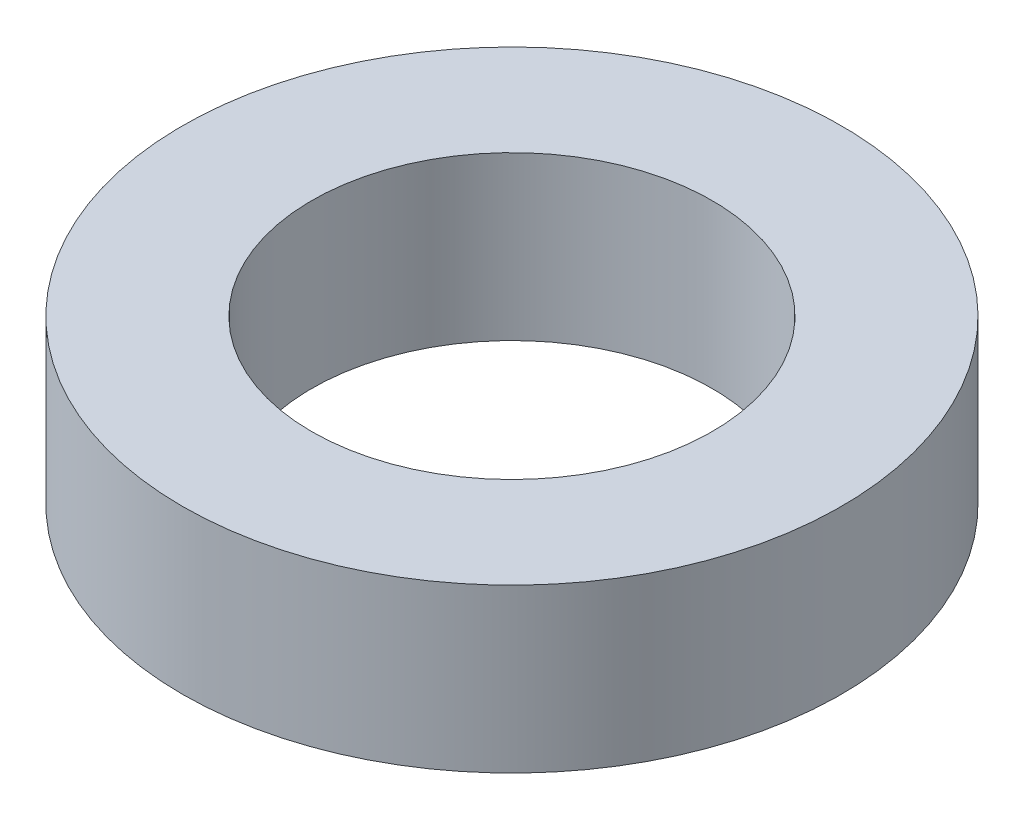
ISO-10303-21;
HEADER;
FILE_DESCRIPTION(('STEP AP214'),'2;1');
FILE_NAME('part.step','',(''),(''),'','','');
FILE_SCHEMA(('AUTOMOTIVE_DESIGN { 1 0 10303 214 1 1 1 1 }'));
ENDSEC;
DATA;
#1=APPLICATION_CONTEXT('core data for automotive mechanical design processes');
#2=APPLICATION_PROTOCOL_DEFINITION('international standard','automotive_design',2000,#1);
#3=PRODUCT_CONTEXT('',#1,'mechanical');
#4=PRODUCT('Part','Part','',(#3));
#5=PRODUCT_RELATED_PRODUCT_CATEGORY('part','',(#4));
#6=PRODUCT_DEFINITION_FORMATION('','',#4);
#7=PRODUCT_DEFINITION_CONTEXT('part definition',#1,'design');
#8=PRODUCT_DEFINITION('design','',#6,#7);
#9=PRODUCT_DEFINITION_SHAPE('','',#8);
#10=(LENGTH_UNIT() NAMED_UNIT(*) SI_UNIT(.MILLI.,.METRE.));
#11=(NAMED_UNIT(*) PLANE_ANGLE_UNIT() SI_UNIT($,.RADIAN.));
#12=(NAMED_UNIT(*) SI_UNIT($,.STERADIAN.) SOLID_ANGLE_UNIT());
#13=UNCERTAINTY_MEASURE_WITH_UNIT(LENGTH_MEASURE(1.E-05),#10,'distance_accuracy_value','');
#14=(GEOMETRIC_REPRESENTATION_CONTEXT(3) GLOBAL_UNCERTAINTY_ASSIGNED_CONTEXT((#13)) GLOBAL_UNIT_ASSIGNED_CONTEXT((#10,
#11,#12)) REPRESENTATION_CONTEXT('',''));
#15=CARTESIAN_POINT('',(0.,0.,0.));
#16=DIRECTION('',(0.,0.,1.));
#17=DIRECTION('',(1.,0.,0.));
#18=AXIS2_PLACEMENT_3D('',#15,#16,#17);
#19=CARTESIAN_POINT('',(0.,10.,0.));
#20=DIRECTION('',(0.,1.,0.));
#21=DIRECTION('',(0.,0.,1.));
#22=AXIS2_PLACEMENT_3D('',#19,#20,#21);
#23=PLANE('',#22);
#24=CARTESIAN_POINT('',(0.,10.,0.));
#25=DIRECTION('',(0.,1.,0.));
#26=DIRECTION('',(0.,0.,1.));
#27=AXIS2_PLACEMENT_3D('',#24,#25,#26);
#28=CIRCLE('',#27,20.25);
#29=CARTESIAN_POINT('',(0.,10.,20.25));
#30=VERTEX_POINT('',#29);
#31=EDGE_CURVE('E10',#30,#30,#28,.T.);
#32=ORIENTED_EDGE('',*,*,#31,.T.);
#33=EDGE_LOOP('',(#32));
#34=FACE_BOUND('',#33,.T.);
#35=CARTESIAN_POINT('',(0.,10.,0.));
#36=DIRECTION('',(0.,1.,0.));
#37=DIRECTION('',(0.,0.,1.));
#38=AXIS2_PLACEMENT_3D('',#35,#36,#37);
#39=CIRCLE('',#38,12.3);
#40=CARTESIAN_POINT('',(0.,10.,12.3));
#41=VERTEX_POINT('',#40);
#42=EDGE_CURVE('E44',#41,#41,#39,.T.);
#43=ORIENTED_EDGE('',*,*,#42,.F.);
#44=EDGE_LOOP('',(#43));
#45=FACE_BOUND('',#44,.T.);
#46=ADVANCED_FACE('F33',(#34,#45),#23,.T.);
#47=CARTESIAN_POINT('',(0.,0.,0.));
#48=DIRECTION('',(0.,1.,0.));
#49=DIRECTION('',(0.,0.,1.));
#50=AXIS2_PLACEMENT_3D('',#47,#48,#49);
#51=PLANE('',#50);
#52=CARTESIAN_POINT('',(0.,0.,0.));
#53=DIRECTION('',(0.,1.,0.));
#54=DIRECTION('',(0.,0.,1.));
#55=AXIS2_PLACEMENT_3D('',#52,#53,#54);
#56=CIRCLE('',#55,20.25);
#57=CARTESIAN_POINT('',(0.,0.,20.25));
#58=VERTEX_POINT('',#57);
#59=EDGE_CURVE('E37',#58,#58,#56,.T.);
#60=ORIENTED_EDGE('',*,*,#59,.F.);
#61=EDGE_LOOP('',(#60));
#62=FACE_BOUND('',#61,.T.);
#63=CARTESIAN_POINT('',(0.,0.,0.));
#64=DIRECTION('',(0.,1.,0.));
#65=DIRECTION('',(0.,0.,1.));
#66=AXIS2_PLACEMENT_3D('',#63,#64,#65);
#67=CIRCLE('',#66,12.3);
#68=CARTESIAN_POINT('',(0.,0.,12.3));
#69=VERTEX_POINT('',#68);
#70=EDGE_CURVE('E46',#69,#69,#67,.T.);
#71=ORIENTED_EDGE('',*,*,#70,.T.);
#72=EDGE_LOOP('',(#71));
#73=FACE_BOUND('',#72,.T.);
#74=ADVANCED_FACE('F56',(#62,#73),#51,.F.);
#75=CARTESIAN_POINT('',(0.,10.,0.));
#76=DIRECTION('',(0.,-1.,0.));
#77=DIRECTION('',(0.,0.,-1.));
#78=AXIS2_PLACEMENT_3D('',#75,#76,#77);
#79=CYLINDRICAL_SURFACE('',#78,20.25);
#80=ORIENTED_EDGE('',*,*,#31,.F.);
#81=EDGE_LOOP('',(#80));
#82=FACE_BOUND('',#81,.T.);
#83=ORIENTED_EDGE('',*,*,#59,.T.);
#84=EDGE_LOOP('',(#83));
#85=FACE_BOUND('',#84,.T.);
#86=ADVANCED_FACE('F35',(#82,#85),#79,.T.);
#87=CARTESIAN_POINT('',(0.,10.,0.));
#88=DIRECTION('',(0.,-1.,0.));
#89=DIRECTION('',(0.,0.,-1.));
#90=AXIS2_PLACEMENT_3D('',#87,#88,#89);
#91=CYLINDRICAL_SURFACE('',#90,12.3);
#92=ORIENTED_EDGE('',*,*,#42,.T.);
#93=EDGE_LOOP('',(#92));
#94=FACE_BOUND('',#93,.T.);
#95=ORIENTED_EDGE('',*,*,#70,.F.);
#96=EDGE_LOOP('',(#95));
#97=FACE_BOUND('',#96,.T.);
#98=ADVANCED_FACE('F52',(#94,#97),#91,.F.);
#99=CLOSED_SHELL('',(#46,#74,#86,#98));
#100=MANIFOLD_SOLID_BREP('B2',#99);
#101=ADVANCED_BREP_SHAPE_REPRESENTATION('',(#18,#100),#14);
#102=SHAPE_DEFINITION_REPRESENTATION(#9,#101);
ENDSEC;
END-ISO-10303-21;
